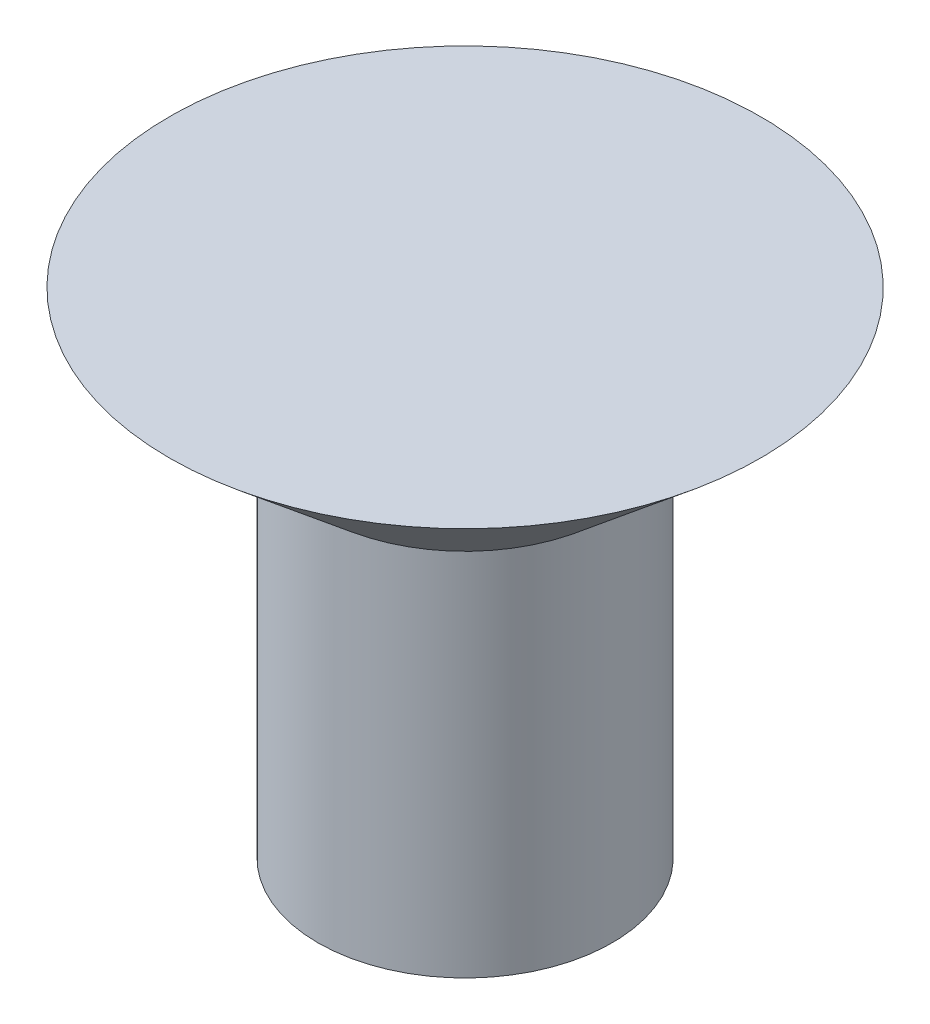
ISO-10303-21;
HEADER;
FILE_DESCRIPTION(('STEP AP214'),'2;1');
FILE_NAME('part.step','',(''),(''),'','','');
FILE_SCHEMA(('AUTOMOTIVE_DESIGN { 1 0 10303 214 1 1 1 1 }'));
ENDSEC;
DATA;
#1=APPLICATION_CONTEXT('core data for automotive mechanical design processes');
#2=APPLICATION_PROTOCOL_DEFINITION('international standard','automotive_design',2000,#1);
#3=PRODUCT_CONTEXT('',#1,'mechanical');
#4=PRODUCT('Part','Part','',(#3));
#5=PRODUCT_RELATED_PRODUCT_CATEGORY('part','',(#4));
#6=PRODUCT_DEFINITION_FORMATION('','',#4);
#7=PRODUCT_DEFINITION_CONTEXT('part definition',#1,'design');
#8=PRODUCT_DEFINITION('design','',#6,#7);
#9=PRODUCT_DEFINITION_SHAPE('','',#8);
#10=(LENGTH_UNIT() NAMED_UNIT(*) SI_UNIT(.MILLI.,.METRE.));
#11=(NAMED_UNIT(*) PLANE_ANGLE_UNIT() SI_UNIT($,.RADIAN.));
#12=(NAMED_UNIT(*) SI_UNIT($,.STERADIAN.) SOLID_ANGLE_UNIT());
#13=UNCERTAINTY_MEASURE_WITH_UNIT(LENGTH_MEASURE(1.E-05),#10,'distance_accuracy_value','');
#14=(GEOMETRIC_REPRESENTATION_CONTEXT(3) GLOBAL_UNCERTAINTY_ASSIGNED_CONTEXT((#13)) GLOBAL_UNIT_ASSIGNED_CONTEXT((#10,
#11,#12)) REPRESENTATION_CONTEXT('',''));
#15=CARTESIAN_POINT('',(0.,0.,0.));
#16=DIRECTION('',(0.,0.,1.));
#17=DIRECTION('',(1.,0.,0.));
#18=AXIS2_PLACEMENT_3D('',#15,#16,#17);
#19=CARTESIAN_POINT('',(0.,0.,-2.85750000000001));
#20=DIRECTION('',(0.,-1.,0.));
#21=DIRECTION('',(0.,0.,-1.));
#22=AXIS2_PLACEMENT_3D('',#19,#20,#21);
#23=PLANE('',#22);
#24=CARTESIAN_POINT('',(0.,0.,0.));
#25=DIRECTION('',(0.,1.,0.));
#26=DIRECTION('',(0.,0.,1.));
#27=AXIS2_PLACEMENT_3D('',#24,#25,#26);
#28=CIRCLE('',#27,2.85750000000001);
#29=CARTESIAN_POINT('',(0.,0.,2.85750000000001));
#30=VERTEX_POINT('',#29);
#31=EDGE_CURVE('E43',#30,#30,#28,.T.);
#32=ORIENTED_EDGE('',*,*,#31,.T.);
#33=EDGE_LOOP('',(#32));
#34=FACE_BOUND('',#33,.T.);
#35=ADVANCED_FACE('F33',(#34),#23,.F.);
#36=CARTESIAN_POINT('',(0.,-4.7752,0.));
#37=DIRECTION('',(0.,1.,0.));
#38=DIRECTION('',(0.,0.,1.));
#39=AXIS2_PLACEMENT_3D('',#36,#37,#38);
#40=PLANE('',#39);
#41=CARTESIAN_POINT('',(0.,-4.7752,0.));
#42=DIRECTION('',(0.,1.,0.));
#43=DIRECTION('',(0.,0.,1.));
#44=AXIS2_PLACEMENT_3D('',#41,#42,#43);
#45=CIRCLE('',#44,1.42240000000001);
#46=CARTESIAN_POINT('',(0.,-4.7752,1.42240000000001));
#47=VERTEX_POINT('',#46);
#48=EDGE_CURVE('E10',#47,#47,#45,.T.);
#49=ORIENTED_EDGE('',*,*,#48,.F.);
#50=EDGE_LOOP('',(#49));
#51=FACE_BOUND('',#50,.T.);
#52=ADVANCED_FACE('F58',(#51),#40,.F.);
#53=CARTESIAN_POINT('',(0.,51.0607269687446,0.));
#54=DIRECTION('',(0.,1.,0.));
#55=DIRECTION('',(0.,0.,1.));
#56=AXIS2_PLACEMENT_3D('',#53,#54,#55);
#57=CYLINDRICAL_SURFACE('',#56,1.42240000000001);
#58=CARTESIAN_POINT('',(0.,-1.20419188070253,0.));
#59=DIRECTION('',(0.,1.,0.));
#60=DIRECTION('',(0.,0.,1.));
#61=AXIS2_PLACEMENT_3D('',#58,#59,#60);
#62=CIRCLE('',#61,1.42240000000001);
#63=CARTESIAN_POINT('',(0.,-1.20419188070253,1.42240000000001));
#64=VERTEX_POINT('',#63);
#65=EDGE_CURVE('E39',#64,#64,#62,.T.);
#66=ORIENTED_EDGE('',*,*,#65,.F.);
#67=EDGE_LOOP('',(#66));
#68=FACE_BOUND('',#67,.T.);
#69=ORIENTED_EDGE('',*,*,#48,.T.);
#70=EDGE_LOOP('',(#69));
#71=FACE_BOUND('',#70,.T.);
#72=ADVANCED_FACE('F53',(#68,#71),#57,.T.);
#73=CARTESIAN_POINT('',(0.,-1.20419188070253,0.));
#74=DIRECTION('',(0.,1.,0.));
#75=DIRECTION('',(0.,0.,1.));
#76=AXIS2_PLACEMENT_3D('',#73,#74,#75);
#77=CONICAL_SURFACE('',#76,1.42240000000001,0.872664625997159);
#78=ORIENTED_EDGE('',*,*,#31,.F.);
#79=EDGE_LOOP('',(#78));
#80=FACE_BOUND('',#79,.T.);
#81=ORIENTED_EDGE('',*,*,#65,.T.);
#82=EDGE_LOOP('',(#81));
#83=FACE_BOUND('',#82,.T.);
#84=ADVANCED_FACE('F51',(#80,#83),#77,.T.);
#85=CLOSED_SHELL('',(#35,#52,#72,#84));
#86=MANIFOLD_SOLID_BREP('B2',#85);
#87=ADVANCED_BREP_SHAPE_REPRESENTATION('',(#18,#86),#14);
#88=SHAPE_DEFINITION_REPRESENTATION(#9,#87);
ENDSEC;
END-ISO-10303-21;
